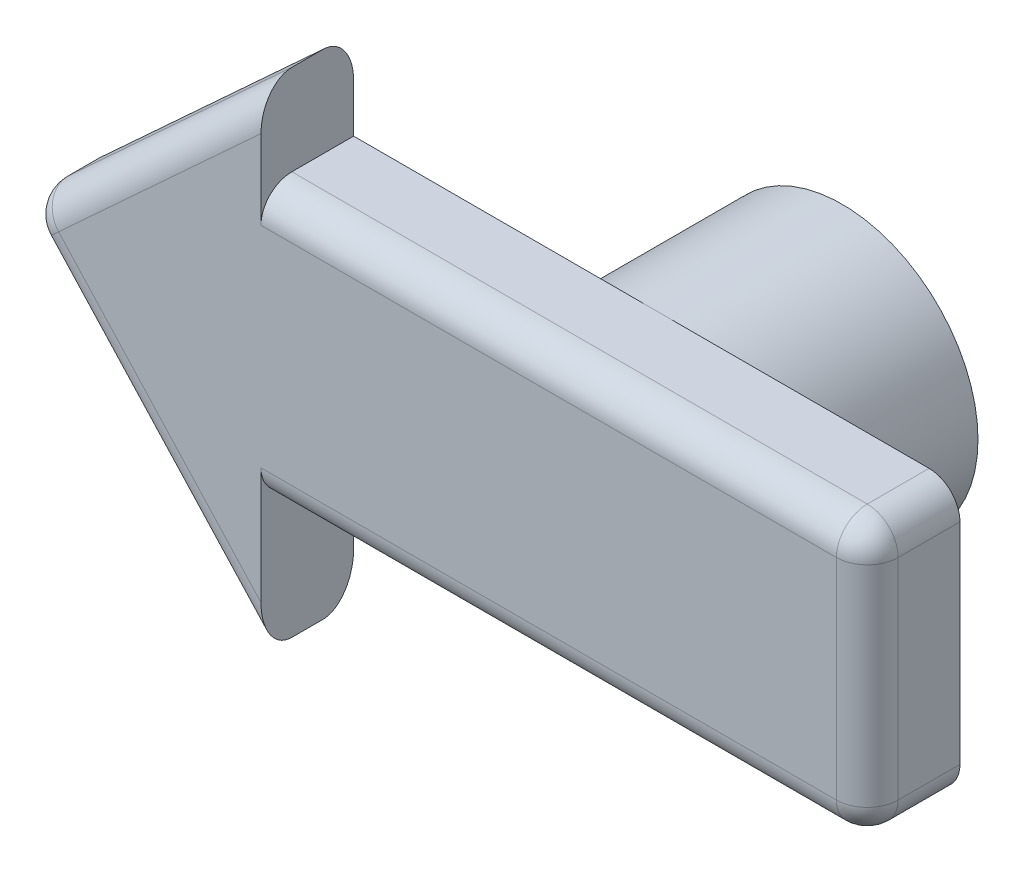
ISO-10303-21;
HEADER;
FILE_DESCRIPTION(('STEP AP214'),'2;1');
FILE_NAME('part.step','',(''),(''),'','','');
FILE_SCHEMA(('AUTOMOTIVE_DESIGN { 1 0 10303 214 1 1 1 1 }'));
ENDSEC;
DATA;
#1=APPLICATION_CONTEXT('core data for automotive mechanical design processes');
#2=APPLICATION_PROTOCOL_DEFINITION('international standard','automotive_design',2000,#1);
#3=PRODUCT_CONTEXT('',#1,'mechanical');
#4=PRODUCT('Part','Part','',(#3));
#5=PRODUCT_RELATED_PRODUCT_CATEGORY('part','',(#4));
#6=PRODUCT_DEFINITION_FORMATION('','',#4);
#7=PRODUCT_DEFINITION_CONTEXT('part definition',#1,'design');
#8=PRODUCT_DEFINITION('design','',#6,#7);
#9=PRODUCT_DEFINITION_SHAPE('','',#8);
#10=(LENGTH_UNIT() NAMED_UNIT(*) SI_UNIT(.MILLI.,.METRE.));
#11=(NAMED_UNIT(*) PLANE_ANGLE_UNIT() SI_UNIT($,.RADIAN.));
#12=(NAMED_UNIT(*) SI_UNIT($,.STERADIAN.) SOLID_ANGLE_UNIT());
#13=UNCERTAINTY_MEASURE_WITH_UNIT(LENGTH_MEASURE(1.E-05),#10,'distance_accuracy_value','');
#14=(GEOMETRIC_REPRESENTATION_CONTEXT(3) GLOBAL_UNCERTAINTY_ASSIGNED_CONTEXT((#13)) GLOBAL_UNIT_ASSIGNED_CONTEXT((#10,
#11,#12)) REPRESENTATION_CONTEXT('',''));
#15=CARTESIAN_POINT('',(0.,0.,0.));
#16=DIRECTION('',(0.,0.,1.));
#17=DIRECTION('',(1.,0.,0.));
#18=AXIS2_PLACEMENT_3D('',#15,#16,#17);
#19=CARTESIAN_POINT('',(0.,-3.7,-6.));
#20=DIRECTION('',(0.,0.,1.));
#21=DIRECTION('',(1.,0.,0.));
#22=AXIS2_PLACEMENT_3D('',#19,#20,#21);
#23=CYLINDRICAL_SURFACE('',#22,4.4);
#24=CARTESIAN_POINT('',(0.,-3.7,-6.));
#25=DIRECTION('',(0.,0.,1.));
#26=DIRECTION('',(1.,0.,0.));
#27=AXIS2_PLACEMENT_3D('',#24,#25,#26);
#28=CIRCLE('',#27,4.4);
#29=CARTESIAN_POINT('',(4.4,-3.7,-6.));
#30=VERTEX_POINT('',#29);
#31=EDGE_CURVE('E203',#30,#30,#28,.T.);
#32=ORIENTED_EDGE('',*,*,#31,.T.);
#33=EDGE_LOOP('',(#32));
#34=FACE_BOUND('',#33,.T.);
#35=CARTESIAN_POINT('',(0.,-3.7,0.));
#36=DIRECTION('',(0.,0.,1.));
#37=DIRECTION('',(1.,0.,0.));
#38=AXIS2_PLACEMENT_3D('',#35,#36,#37);
#39=CIRCLE('',#38,4.4);
#40=CARTESIAN_POINT('',(0.,0.700000000000001,0.));
#41=VERTEX_POINT('',#40);
#42=CARTESIAN_POINT('',(0.,-8.1,0.));
#43=VERTEX_POINT('',#42);
#44=EDGE_CURVE('E175',#41,#43,#39,.T.);
#45=ORIENTED_EDGE('',*,*,#44,.F.);
#46=EDGE_CURVE('E200',#43,#41,#39,.T.);
#47=ORIENTED_EDGE('',*,*,#46,.F.);
#48=EDGE_LOOP('',(#45,#47));
#49=FACE_BOUND('',#48,.T.);
#50=ADVANCED_FACE('F33',(#34,#49),#23,.T.);
#51=CARTESIAN_POINT('',(0.,-3.7,-6.));
#52=DIRECTION('',(0.,0.,1.));
#53=DIRECTION('',(1.,0.,0.));
#54=AXIS2_PLACEMENT_3D('',#51,#52,#53);
#55=PLANE('',#54);
#56=CARTESIAN_POINT('',(0.,-3.7,-6.));
#57=DIRECTION('',(0.,0.,1.));
#58=DIRECTION('',(1.,0.,0.));
#59=AXIS2_PLACEMENT_3D('',#56,#57,#58);
#60=CIRCLE('',#59,3.1);
#61=CARTESIAN_POINT('',(3.1,-3.7,-6.));
#62=VERTEX_POINT('',#61);
#63=EDGE_CURVE('E197',#62,#62,#60,.T.);
#64=ORIENTED_EDGE('',*,*,#63,.T.);
#65=EDGE_LOOP('',(#64));
#66=FACE_BOUND('',#65,.T.);
#67=ORIENTED_EDGE('',*,*,#31,.F.);
#68=EDGE_LOOP('',(#67));
#69=FACE_BOUND('',#68,.T.);
#70=ADVANCED_FACE('F357',(#66,#69),#55,.F.);
#71=CARTESIAN_POINT('',(0.,-3.7,-6.));
#72=DIRECTION('',(0.,0.,1.));
#73=DIRECTION('',(1.,0.,0.));
#74=AXIS2_PLACEMENT_3D('',#71,#72,#73);
#75=CYLINDRICAL_SURFACE('',#74,3.1);
#76=ORIENTED_EDGE('',*,*,#63,.F.);
#77=EDGE_LOOP('',(#76));
#78=FACE_BOUND('',#77,.T.);
#79=CARTESIAN_POINT('',(0.,-3.7,0.));
#80=DIRECTION('',(0.,0.,1.));
#81=DIRECTION('',(1.,0.,0.));
#82=AXIS2_PLACEMENT_3D('',#79,#80,#81);
#83=CIRCLE('',#82,3.1);
#84=CARTESIAN_POINT('',(3.1,-3.7,0.));
#85=VERTEX_POINT('',#84);
#86=EDGE_CURVE('E196',#85,#85,#83,.T.);
#87=ORIENTED_EDGE('',*,*,#86,.T.);
#88=EDGE_LOOP('',(#87));
#89=FACE_BOUND('',#88,.T.);
#90=ADVANCED_FACE('F363',(#78,#89),#75,.F.);
#91=CARTESIAN_POINT('',(0.,0.,0.));
#92=DIRECTION('',(0.,0.,-1.));
#93=DIRECTION('',(-1.,0.,0.));
#94=AXIS2_PLACEMENT_3D('',#91,#92,#93);
#95=PLANE('',#94);
#96=DIRECTION('',(-1.,0.,0.));
#97=VECTOR('',#96,1.);
#98=CARTESIAN_POINT('',(9.81520328825524,0.700000000000001,0.));
#99=LINE('',#98,#97);
#100=CARTESIAN_POINT('',(8.81520328825524,0.700000000000001,0.));
#101=VERTEX_POINT('',#100);
#102=EDGE_CURVE('E184',#101,#41,#99,.T.);
#103=ORIENTED_EDGE('',*,*,#102,.F.);
#104=CARTESIAN_POINT('',(8.81520328825524,-0.299999999999999,0.));
#105=DIRECTION('',(0.,0.,-1.));
#106=DIRECTION('',(-1.,0.,0.));
#107=AXIS2_PLACEMENT_3D('',#104,#105,#106);
#108=CIRCLE('',#107,1.);
#109=CARTESIAN_POINT('',(9.81520328825524,-0.3,0.));
#110=VERTEX_POINT('',#109);
#111=EDGE_CURVE('E256',#101,#110,#108,.T.);
#112=ORIENTED_EDGE('',*,*,#111,.T.);
#113=DIRECTION('',(0.,1.,0.));
#114=VECTOR('',#113,1.);
#115=CARTESIAN_POINT('',(9.81520328825524,-8.1,0.));
#116=LINE('',#115,#114);
#117=CARTESIAN_POINT('',(9.81520328825524,-7.1,0.));
#118=VERTEX_POINT('',#117);
#119=EDGE_CURVE('E177',#118,#110,#116,.T.);
#120=ORIENTED_EDGE('',*,*,#119,.F.);
#121=CARTESIAN_POINT('',(8.81520328825524,-7.1,0.));
#122=DIRECTION('',(0.,0.,-1.));
#123=DIRECTION('',(-1.,0.,0.));
#124=AXIS2_PLACEMENT_3D('',#121,#122,#123);
#125=CIRCLE('',#124,1.);
#126=CARTESIAN_POINT('',(8.81520328825524,-8.1,0.));
#127=VERTEX_POINT('',#126);
#128=EDGE_CURVE('E254',#118,#127,#125,.T.);
#129=ORIENTED_EDGE('',*,*,#128,.T.);
#130=DIRECTION('',(1.,0.,0.));
#131=VECTOR('',#130,1.);
#132=CARTESIAN_POINT('',(9.81520328825524,-8.1,0.));
#133=LINE('',#132,#131);
#134=EDGE_CURVE('E158',#43,#127,#133,.T.);
#135=ORIENTED_EDGE('',*,*,#134,.F.);
#136=ORIENTED_EDGE('',*,*,#46,.T.);
#137=EDGE_LOOP('',(#103,#112,#120,#129,#135,#136));
#138=FACE_BOUND('',#137,.T.);
#139=ADVANCED_FACE('F322',(#138),#95,.T.);
#140=CARTESIAN_POINT('',(0.,0.,3.));
#141=DIRECTION('',(0.,0.,-1.));
#142=DIRECTION('',(-1.,0.,0.));
#143=AXIS2_PLACEMENT_3D('',#140,#141,#142);
#144=PLANE('',#143);
#145=DIRECTION('',(-1.,0.,0.));
#146=VECTOR('',#145,1.);
#147=CARTESIAN_POINT('',(0.,-0.299999999999999,3.));
#148=LINE('',#147,#146);
#149=CARTESIAN_POINT('',(8.81520328825524,-0.299999999999999,3.));
#150=VERTEX_POINT('',#149);
#151=CARTESIAN_POINT('',(-9.81520328825525,-0.299999999999999,3.));
#152=VERTEX_POINT('',#151);
#153=EDGE_CURVE('E217',#150,#152,#148,.T.);
#154=ORIENTED_EDGE('',*,*,#153,.T.);
#155=DIRECTION('',(0.,1.,0.));
#156=VECTOR('',#155,1.);
#157=CARTESIAN_POINT('',(-9.81520328825525,3.62919736532176,3.));
#158=LINE('',#157,#156);
#159=CARTESIAN_POINT('',(-9.81520328825525,2.27021448656478,3.));
#160=VERTEX_POINT('',#159);
#161=EDGE_CURVE('E193',#152,#160,#158,.T.);
#162=ORIENTED_EDGE('',*,*,#161,.T.);
#163=DIRECTION('',(-0.735844443393335,-0.677150614802315,0.));
#164=VECTOR('',#163,1.);
#165=CARTESIAN_POINT('',(-5.63179100691126,6.11994145497162,3.));
#166=LINE('',#165,#164);
#167=CARTESIAN_POINT('',(-16.3666832492243,-3.75869382859102,3.));
#168=VERTEX_POINT('',#167);
#169=EDGE_CURVE('E209',#160,#168,#166,.T.);
#170=ORIENTED_EDGE('',*,*,#169,.T.);
#171=DIRECTION('',(0.677150614802315,-0.735844443393335,0.));
#172=VECTOR('',#171,1.);
#173=CARTESIAN_POINT('',(-10.7348922423131,-9.87863528356264,3.));
#174=LINE('',#173,#172);
#175=CARTESIAN_POINT('',(-9.81520328825525,-10.8780407211421,3.));
#176=VERTEX_POINT('',#175);
#177=EDGE_CURVE('E206',#168,#176,#174,.T.);
#178=ORIENTED_EDGE('',*,*,#177,.T.);
#179=DIRECTION('',(0.,1.,0.));
#180=VECTOR('',#179,1.);
#181=CARTESIAN_POINT('',(-9.81520328825525,-8.1,3.));
#182=LINE('',#181,#180);
#183=CARTESIAN_POINT('',(-9.81520328825525,-7.1,3.));
#184=VERTEX_POINT('',#183);
#185=EDGE_CURVE('E189',#176,#184,#182,.T.);
#186=ORIENTED_EDGE('',*,*,#185,.T.);
#187=DIRECTION('',(1.,0.,0.));
#188=VECTOR('',#187,1.);
#189=CARTESIAN_POINT('',(0.,-7.1,3.));
#190=LINE('',#189,#188);
#191=CARTESIAN_POINT('',(8.81520328825524,-7.1,3.));
#192=VERTEX_POINT('',#191);
#193=EDGE_CURVE('E212',#184,#192,#190,.T.);
#194=ORIENTED_EDGE('',*,*,#193,.T.);
#195=DIRECTION('',(0.,1.,0.));
#196=VECTOR('',#195,1.);
#197=CARTESIAN_POINT('',(8.81520328825524,0.,3.));
#198=LINE('',#197,#196);
#199=EDGE_CURVE('E214',#192,#150,#198,.T.);
#200=ORIENTED_EDGE('',*,*,#199,.T.);
#201=EDGE_LOOP('',(#154,#162,#170,#178,#186,#194,#200));
#202=FACE_BOUND('',#201,.T.);
#203=ADVANCED_FACE('F539',(#202),#144,.F.);
#204=CARTESIAN_POINT('',(-17.77967830742,-3.7,3.));
#205=DIRECTION('',(0.677150614802315,-0.735844443393335,0.));
#206=DIRECTION('',(0.735844443393335,0.677150614802315,0.));
#207=AXIS2_PLACEMENT_3D('',#204,#205,#206);
#208=PLANE('',#207);
#209=DIRECTION('',(0.,0.,-1.));
#210=VECTOR('',#209,1.);
#211=CARTESIAN_POINT('',(-17.0438338640267,-3.02284938519769,3.));
#212=LINE('',#211,#210);
#213=CARTESIAN_POINT('',(-17.0438338640267,-3.02284938519769,1.));
#214=VERTEX_POINT('',#213);
#215=CARTESIAN_POINT('',(-17.0438338640267,-3.02284938519769,2.));
#216=VERTEX_POINT('',#215);
#217=EDGE_CURVE('E233',#214,#216,#212,.F.);
#218=ORIENTED_EDGE('',*,*,#217,.T.);
#219=DIRECTION('',(-0.735844443393335,-0.677150614802315,0.));
#220=VECTOR('',#219,1.);
#221=CARTESIAN_POINT('',(-17.77967830742,-3.7,2.));
#222=LINE('',#221,#220);
#223=CARTESIAN_POINT('',(-9.81520328825525,3.62919736532176,2.));
#224=VERTEX_POINT('',#223);
#225=EDGE_CURVE('E237',#216,#224,#222,.F.);
#226=ORIENTED_EDGE('',*,*,#225,.T.);
#227=DIRECTION('',(0.,0.,-1.));
#228=VECTOR('',#227,1.);
#229=CARTESIAN_POINT('',(-9.81520328825525,3.62919736532176,3.));
#230=LINE('',#229,#228);
#231=CARTESIAN_POINT('',(-9.81520328825525,3.62919736532176,1.));
#232=VERTEX_POINT('',#231);
#233=EDGE_CURVE('E190',#224,#232,#230,.T.);
#234=ORIENTED_EDGE('',*,*,#233,.T.);
#235=DIRECTION('',(-0.735844443393335,-0.677150614802315,0.));
#236=VECTOR('',#235,1.);
#237=CARTESIAN_POINT('',(-17.77967830742,-3.7,1.));
#238=LINE('',#237,#236);
#239=EDGE_CURVE('E235',#232,#214,#238,.T.);
#240=ORIENTED_EDGE('',*,*,#239,.T.);
#241=EDGE_LOOP('',(#218,#226,#234,#240));
#242=FACE_BOUND('',#241,.T.);
#243=ADVANCED_FACE('F301',(#242),#208,.F.);
#244=CARTESIAN_POINT('',(-9.81520328825525,3.62919736532176,3.));
#245=DIRECTION('',(-1.,0.,0.));
#246=DIRECTION('',(0.,0.,1.));
#247=AXIS2_PLACEMENT_3D('',#244,#245,#246);
#248=PLANE('',#247);
#249=ORIENTED_EDGE('',*,*,#233,.F.);
#250=CARTESIAN_POINT('',(-9.81520328825525,2.27021448656478,2.));
#251=DIRECTION('',(-1.,0.,0.));
#252=DIRECTION('',(0.,-1.,0.));
#253=AXIS2_PLACEMENT_3D('',#250,#251,#252);
#254=ELLIPSE('',#253,1.35898287875698,1.);
#255=EDGE_CURVE('E241',#224,#160,#254,.F.);
#256=ORIENTED_EDGE('',*,*,#255,.T.);
#257=ORIENTED_EDGE('',*,*,#161,.F.);
#258=CARTESIAN_POINT('',(-9.81520328825525,-0.299999999999999,2.));
#259=DIRECTION('',(-1.,0.,0.));
#260=DIRECTION('',(0.,0.,1.));
#261=AXIS2_PLACEMENT_3D('',#258,#259,#260);
#262=CIRCLE('',#261,1.);
#263=CARTESIAN_POINT('',(-9.81520328825525,0.700000000000001,2.));
#264=VERTEX_POINT('',#263);
#265=EDGE_CURVE('E42',#152,#264,#262,.T.);
#266=ORIENTED_EDGE('',*,*,#265,.T.);
#267=DIRECTION('',(0.,0.,-1.));
#268=VECTOR('',#267,1.);
#269=CARTESIAN_POINT('',(-9.81520328825525,0.700000000000001,3.));
#270=LINE('',#269,#268);
#271=CARTESIAN_POINT('',(-9.81520328825525,0.700000000000001,0.));
#272=VERTEX_POINT('',#271);
#273=EDGE_CURVE('E169',#264,#272,#270,.T.);
#274=ORIENTED_EDGE('',*,*,#273,.T.);
#275=DIRECTION('',(0.,1.,0.));
#276=VECTOR('',#275,1.);
#277=CARTESIAN_POINT('',(-9.81520328825525,3.62919736532176,0.));
#278=LINE('',#277,#276);
#279=CARTESIAN_POINT('',(-9.81520328825525,2.27021448656478,0.));
#280=VERTEX_POINT('',#279);
#281=EDGE_CURVE('E186',#272,#280,#278,.T.);
#282=ORIENTED_EDGE('',*,*,#281,.T.);
#283=CARTESIAN_POINT('',(-9.81520328825525,2.27021448656478,1.));
#284=DIRECTION('',(-1.,0.,0.));
#285=DIRECTION('',(0.,1.,0.));
#286=AXIS2_PLACEMENT_3D('',#283,#284,#285);
#287=ELLIPSE('',#286,1.35898287875698,1.);
#288=EDGE_CURVE('E239',#280,#232,#287,.F.);
#289=ORIENTED_EDGE('',*,*,#288,.T.);
#290=EDGE_LOOP('',(#249,#256,#257,#266,#274,#282,#289));
#291=FACE_BOUND('',#290,.T.);
#292=ADVANCED_FACE('F309',(#291),#248,.F.);
#293=CARTESIAN_POINT('',(9.81520328825524,0.700000000000001,3.));
#294=DIRECTION('',(0.,-1.,0.));
#295=DIRECTION('',(0.,0.,-1.));
#296=AXIS2_PLACEMENT_3D('',#293,#294,#295);
#297=PLANE('',#296);
#298=ORIENTED_EDGE('',*,*,#273,.F.);
#299=DIRECTION('',(-1.,0.,0.));
#300=VECTOR('',#299,1.);
#301=CARTESIAN_POINT('',(9.81520328825524,0.700000000000001,2.));
#302=LINE('',#301,#300);
#303=CARTESIAN_POINT('',(8.81520328825524,0.700000000000001,2.));
#304=VERTEX_POINT('',#303);
#305=EDGE_CURVE('E228',#264,#304,#302,.F.);
#306=ORIENTED_EDGE('',*,*,#305,.T.);
#307=DIRECTION('',(0.,0.,-1.));
#308=VECTOR('',#307,1.);
#309=CARTESIAN_POINT('',(8.81520328825524,0.700000000000001,3.));
#310=LINE('',#309,#308);
#311=EDGE_CURVE('E226',#304,#101,#310,.T.);
#312=ORIENTED_EDGE('',*,*,#311,.T.);
#313=ORIENTED_EDGE('',*,*,#102,.T.);
#314=EDGE_CURVE('E180',#41,#272,#99,.T.);
#315=ORIENTED_EDGE('',*,*,#314,.T.);
#316=EDGE_LOOP('',(#298,#306,#312,#313,#315));
#317=FACE_BOUND('',#316,.T.);
#318=ADVANCED_FACE('F315',(#317),#297,.F.);
#319=CARTESIAN_POINT('',(9.81520328825524,-8.1,3.));
#320=DIRECTION('',(-1.,0.,0.));
#321=DIRECTION('',(0.,0.,1.));
#322=AXIS2_PLACEMENT_3D('',#319,#320,#321);
#323=PLANE('',#322);
#324=ORIENTED_EDGE('',*,*,#119,.T.);
#325=DIRECTION('',(0.,0.,-1.));
#326=VECTOR('',#325,1.);
#327=CARTESIAN_POINT('',(9.81520328825524,-0.3,3.));
#328=LINE('',#327,#326);
#329=CARTESIAN_POINT('',(9.81520328825524,-0.299999999999999,2.));
#330=VERTEX_POINT('',#329);
#331=EDGE_CURVE('E224',#110,#330,#328,.F.);
#332=ORIENTED_EDGE('',*,*,#331,.T.);
#333=DIRECTION('',(0.,1.,0.));
#334=VECTOR('',#333,1.);
#335=CARTESIAN_POINT('',(9.81520328825524,-8.1,2.));
#336=LINE('',#335,#334);
#337=CARTESIAN_POINT('',(9.81520328825524,-7.1,2.));
#338=VERTEX_POINT('',#337);
#339=EDGE_CURVE('E222',#330,#338,#336,.F.);
#340=ORIENTED_EDGE('',*,*,#339,.T.);
#341=DIRECTION('',(0.,0.,-1.));
#342=VECTOR('',#341,1.);
#343=CARTESIAN_POINT('',(9.81520328825524,-7.1,3.));
#344=LINE('',#343,#342);
#345=EDGE_CURVE('E220',#338,#118,#344,.T.);
#346=ORIENTED_EDGE('',*,*,#345,.T.);
#347=EDGE_LOOP('',(#324,#332,#340,#346));
#348=FACE_BOUND('',#347,.T.);
#349=ADVANCED_FACE('F509',(#348),#323,.F.);
#350=CARTESIAN_POINT('',(9.81520328825524,-8.1,3.));
#351=DIRECTION('',(0.,1.,0.));
#352=DIRECTION('',(0.,0.,1.));
#353=AXIS2_PLACEMENT_3D('',#350,#351,#352);
#354=PLANE('',#353);
#355=DIRECTION('',(0.,0.,-1.));
#356=VECTOR('',#355,1.);
#357=CARTESIAN_POINT('',(8.81520328825524,-8.1,3.));
#358=LINE('',#357,#356);
#359=CARTESIAN_POINT('',(8.81520328825524,-8.1,2.));
#360=VERTEX_POINT('',#359);
#361=EDGE_CURVE('E230',#127,#360,#358,.F.);
#362=ORIENTED_EDGE('',*,*,#361,.T.);
#363=DIRECTION('',(1.,0.,0.));
#364=VECTOR('',#363,1.);
#365=CARTESIAN_POINT('',(9.81520328825524,-8.1,2.));
#366=LINE('',#365,#364);
#367=CARTESIAN_POINT('',(-9.81520328825525,-8.1,2.));
#368=VERTEX_POINT('',#367);
#369=EDGE_CURVE('E167',#360,#368,#366,.F.);
#370=ORIENTED_EDGE('',*,*,#369,.T.);
#371=DIRECTION('',(0.,0.,-1.));
#372=VECTOR('',#371,1.);
#373=CARTESIAN_POINT('',(-9.81520328825525,-8.1,3.));
#374=LINE('',#373,#372);
#375=CARTESIAN_POINT('',(-9.81520328825525,-8.1,0.));
#376=VERTEX_POINT('',#375);
#377=EDGE_CURVE('E152',#368,#376,#374,.T.);
#378=ORIENTED_EDGE('',*,*,#377,.T.);
#379=EDGE_CURVE('E165',#376,#43,#133,.T.);
#380=ORIENTED_EDGE('',*,*,#379,.T.);
#381=ORIENTED_EDGE('',*,*,#134,.T.);
#382=EDGE_LOOP('',(#362,#370,#378,#380,#381));
#383=FACE_BOUND('',#382,.T.);
#384=ADVANCED_FACE('F163',(#383),#354,.F.);
#385=CARTESIAN_POINT('',(-9.81520328825525,-8.1,3.));
#386=DIRECTION('',(-1.,0.,0.));
#387=DIRECTION('',(0.,0.,1.));
#388=AXIS2_PLACEMENT_3D('',#385,#386,#387);
#389=PLANE('',#388);
#390=ORIENTED_EDGE('',*,*,#185,.F.);
#391=CARTESIAN_POINT('',(-9.81520328825525,-10.8780407211421,2.));
#392=DIRECTION('',(-1.,0.,0.));
#393=DIRECTION('',(0.,-1.,0.));
#394=AXIS2_PLACEMENT_3D('',#391,#392,#393);
#395=ELLIPSE('',#394,1.4767763303175,1.);
#396=CARTESIAN_POINT('',(-9.81520328825525,-12.3548170514596,2.));
#397=VERTEX_POINT('',#396);
#398=EDGE_CURVE('E244',#176,#397,#395,.F.);
#399=ORIENTED_EDGE('',*,*,#398,.T.);
#400=DIRECTION('',(0.,0.,-1.));
#401=VECTOR('',#400,1.);
#402=CARTESIAN_POINT('',(-9.81520328825525,-12.3548170514596,3.));
#403=LINE('',#402,#401);
#404=CARTESIAN_POINT('',(-9.81520328825525,-12.3548170514596,1.));
#405=VERTEX_POINT('',#404);
#406=EDGE_CURVE('E168',#397,#405,#403,.T.);
#407=ORIENTED_EDGE('',*,*,#406,.T.);
#408=CARTESIAN_POINT('',(-9.81520328825525,-10.8780407211421,1.));
#409=DIRECTION('',(-1.,0.,0.));
#410=DIRECTION('',(0.,1.,0.));
#411=AXIS2_PLACEMENT_3D('',#408,#409,#410);
#412=ELLIPSE('',#411,1.4767763303175,1.);
#413=CARTESIAN_POINT('',(-9.81520328825525,-10.8780407211421,0.));
#414=VERTEX_POINT('',#413);
#415=EDGE_CURVE('E156',#405,#414,#412,.F.);
#416=ORIENTED_EDGE('',*,*,#415,.T.);
#417=DIRECTION('',(0.,1.,0.));
#418=VECTOR('',#417,1.);
#419=CARTESIAN_POINT('',(-9.81520328825525,-8.1,0.));
#420=LINE('',#419,#418);
#421=EDGE_CURVE('E148',#414,#376,#420,.T.);
#422=ORIENTED_EDGE('',*,*,#421,.T.);
#423=ORIENTED_EDGE('',*,*,#377,.F.);
#424=CARTESIAN_POINT('',(-9.81520328825525,-7.1,2.));
#425=DIRECTION('',(-1.,0.,0.));
#426=DIRECTION('',(0.,0.,1.));
#427=AXIS2_PLACEMENT_3D('',#424,#425,#426);
#428=CIRCLE('',#427,1.);
#429=EDGE_CURVE('E11',#368,#184,#428,.T.);
#430=ORIENTED_EDGE('',*,*,#429,.T.);
#431=EDGE_LOOP('',(#390,#399,#407,#416,#422,#423,#430));
#432=FACE_BOUND('',#431,.T.);
#433=ADVANCED_FACE('F151',(#432),#389,.F.);
#434=CARTESIAN_POINT('',(-9.81520328825525,-12.3548170514596,3.));
#435=DIRECTION('',(0.735844443393335,0.677150614802315,0.));
#436=DIRECTION('',(-0.677150614802315,0.735844443393335,0.));
#437=AXIS2_PLACEMENT_3D('',#434,#435,#436);
#438=PLANE('',#437);
#439=ORIENTED_EDGE('',*,*,#406,.F.);
#440=DIRECTION('',(0.677150614802315,-0.735844443393335,0.));
#441=VECTOR('',#440,1.);
#442=CARTESIAN_POINT('',(-9.81520328825525,-12.3548170514596,2.));
#443=LINE('',#442,#441);
#444=CARTESIAN_POINT('',(-17.1025276926177,-4.43584444339334,2.));
#445=VERTEX_POINT('',#444);
#446=EDGE_CURVE('E249',#397,#445,#443,.F.);
#447=ORIENTED_EDGE('',*,*,#446,.T.);
#448=DIRECTION('',(0.,0.,-1.));
#449=VECTOR('',#448,1.);
#450=CARTESIAN_POINT('',(-17.1025276926177,-4.43584444339334,3.));
#451=LINE('',#450,#449);
#452=CARTESIAN_POINT('',(-17.1025276926177,-4.43584444339334,1.));
#453=VERTEX_POINT('',#452);
#454=EDGE_CURVE('E58',#445,#453,#451,.T.);
#455=ORIENTED_EDGE('',*,*,#454,.T.);
#456=DIRECTION('',(0.677150614802315,-0.735844443393335,0.));
#457=VECTOR('',#456,1.);
#458=CARTESIAN_POINT('',(-9.81520328825525,-12.3548170514596,1.));
#459=LINE('',#458,#457);
#460=EDGE_CURVE('E247',#453,#405,#459,.T.);
#461=ORIENTED_EDGE('',*,*,#460,.T.);
#462=EDGE_LOOP('',(#439,#447,#455,#461));
#463=FACE_BOUND('',#462,.T.);
#464=ADVANCED_FACE('F346',(#463),#438,.F.);
#465=ORIENTED_EDGE('',*,*,#421,.F.);
#466=DIRECTION('',(0.677150614802315,-0.735844443393335,0.));
#467=VECTOR('',#466,1.);
#468=CARTESIAN_POINT('',(-17.0438338640267,-3.02284938519768,0.));
#469=LINE('',#468,#467);
#470=CARTESIAN_POINT('',(-16.3666832492243,-3.75869382859102,0.));
#471=VERTEX_POINT('',#470);
#472=EDGE_CURVE('E50',#414,#471,#469,.F.);
#473=ORIENTED_EDGE('',*,*,#472,.T.);
#474=DIRECTION('',(-0.735844443393335,-0.677150614802315,0.));
#475=VECTOR('',#474,1.);
#476=CARTESIAN_POINT('',(-9.13805267345293,2.89335292192843,0.));
#477=LINE('',#476,#475);
#478=EDGE_CURVE('E251',#471,#280,#477,.F.);
#479=ORIENTED_EDGE('',*,*,#478,.T.);
#480=ORIENTED_EDGE('',*,*,#281,.F.);
#481=ORIENTED_EDGE('',*,*,#314,.F.);
#482=ORIENTED_EDGE('',*,*,#44,.T.);
#483=ORIENTED_EDGE('',*,*,#379,.F.);
#484=EDGE_LOOP('',(#465,#473,#479,#480,#481,#482,#483));
#485=FACE_BOUND('',#484,.T.);
#486=ADVANCED_FACE('F172',(#485),#95,.T.);
#487=ORIENTED_EDGE('',*,*,#86,.F.);
#488=EDGE_LOOP('',(#487));
#489=FACE_BOUND('',#488,.T.);
#490=ADVANCED_FACE('F385',(#489),#95,.T.);
#491=CARTESIAN_POINT('',(8.81520328825524,-7.1,3.));
#492=DIRECTION('',(0.,0.,-1.));
#493=DIRECTION('',(-1.,0.,0.));
#494=AXIS2_PLACEMENT_3D('',#491,#492,#493);
#495=CYLINDRICAL_SURFACE('',#494,1.);
#496=ORIENTED_EDGE('',*,*,#128,.F.);
#497=ORIENTED_EDGE('',*,*,#345,.F.);
#498=CARTESIAN_POINT('',(8.81520328825524,-7.1,2.));
#499=DIRECTION('',(0.,0.,1.));
#500=DIRECTION('',(1.,0.,0.));
#501=AXIS2_PLACEMENT_3D('',#498,#499,#500);
#502=CIRCLE('',#501,1.);
#503=EDGE_CURVE('E159',#360,#338,#502,.T.);
#504=ORIENTED_EDGE('',*,*,#503,.F.);
#505=ORIENTED_EDGE('',*,*,#361,.F.);
#506=EDGE_LOOP('',(#496,#497,#504,#505));
#507=FACE_BOUND('',#506,.T.);
#508=ADVANCED_FACE('F328',(#507),#495,.T.);
#509=CARTESIAN_POINT('',(0.,-7.1,2.));
#510=DIRECTION('',(1.,0.,0.));
#511=DIRECTION('',(0.,0.,-1.));
#512=AXIS2_PLACEMENT_3D('',#509,#510,#511);
#513=CYLINDRICAL_SURFACE('',#512,1.);
#514=ORIENTED_EDGE('',*,*,#429,.F.);
#515=ORIENTED_EDGE('',*,*,#369,.F.);
#516=CARTESIAN_POINT('',(8.81520328825524,-7.1,2.));
#517=DIRECTION('',(1.,0.,0.));
#518=DIRECTION('',(0.,0.,-1.));
#519=AXIS2_PLACEMENT_3D('',#516,#517,#518);
#520=CIRCLE('',#519,1.);
#521=EDGE_CURVE('E270',#192,#360,#520,.T.);
#522=ORIENTED_EDGE('',*,*,#521,.F.);
#523=ORIENTED_EDGE('',*,*,#193,.F.);
#524=EDGE_LOOP('',(#514,#515,#522,#523));
#525=FACE_BOUND('',#524,.T.);
#526=ADVANCED_FACE('F337',(#525),#513,.T.);
#527=CARTESIAN_POINT('',(0.,-0.299999999999999,2.));
#528=DIRECTION('',(-1.,0.,0.));
#529=DIRECTION('',(0.,0.,1.));
#530=AXIS2_PLACEMENT_3D('',#527,#528,#529);
#531=CYLINDRICAL_SURFACE('',#530,1.);
#532=ORIENTED_EDGE('',*,*,#265,.F.);
#533=ORIENTED_EDGE('',*,*,#153,.F.);
#534=CARTESIAN_POINT('',(8.81520328825524,-0.299999999999999,2.));
#535=DIRECTION('',(1.,0.,0.));
#536=DIRECTION('',(0.,0.,-1.));
#537=AXIS2_PLACEMENT_3D('',#534,#535,#536);
#538=CIRCLE('',#537,1.);
#539=EDGE_CURVE('E267',#304,#150,#538,.T.);
#540=ORIENTED_EDGE('',*,*,#539,.F.);
#541=ORIENTED_EDGE('',*,*,#305,.F.);
#542=EDGE_LOOP('',(#532,#533,#540,#541));
#543=FACE_BOUND('',#542,.T.);
#544=ADVANCED_FACE('F376',(#543),#531,.T.);
#545=CARTESIAN_POINT('',(8.81520328825524,-0.299999999999999,3.));
#546=DIRECTION('',(0.,0.,-1.));
#547=DIRECTION('',(-1.,0.,0.));
#548=AXIS2_PLACEMENT_3D('',#545,#546,#547);
#549=CYLINDRICAL_SURFACE('',#548,1.);
#550=ORIENTED_EDGE('',*,*,#111,.F.);
#551=ORIENTED_EDGE('',*,*,#311,.F.);
#552=CARTESIAN_POINT('',(8.81520328825524,-0.299999999999999,2.));
#553=DIRECTION('',(0.,0.,1.));
#554=DIRECTION('',(1.,0.,0.));
#555=AXIS2_PLACEMENT_3D('',#552,#553,#554);
#556=CIRCLE('',#555,1.);
#557=EDGE_CURVE('E264',#330,#304,#556,.T.);
#558=ORIENTED_EDGE('',*,*,#557,.F.);
#559=ORIENTED_EDGE('',*,*,#331,.F.);
#560=EDGE_LOOP('',(#550,#551,#558,#559));
#561=FACE_BOUND('',#560,.T.);
#562=ADVANCED_FACE('F373',(#561),#549,.T.);
#563=CARTESIAN_POINT('',(8.81520328825524,-7.1,2.));
#564=DIRECTION('',(0.,0.,1.));
#565=DIRECTION('',(1.,0.,0.));
#566=AXIS2_PLACEMENT_3D('',#563,#564,#565);
#567=SPHERICAL_SURFACE('',#566,1.);
#568=ORIENTED_EDGE('',*,*,#521,.T.);
#569=ORIENTED_EDGE('',*,*,#503,.T.);
#570=CARTESIAN_POINT('',(8.81520328825524,-7.1,2.));
#571=DIRECTION('',(0.,-1.,0.));
#572=DIRECTION('',(0.,0.,-1.));
#573=AXIS2_PLACEMENT_3D('',#570,#571,#572);
#574=CIRCLE('',#573,1.);
#575=EDGE_CURVE('E261',#192,#338,#574,.F.);
#576=ORIENTED_EDGE('',*,*,#575,.F.);
#577=EDGE_LOOP('',(#568,#569,#576));
#578=FACE_BOUND('',#577,.T.);
#579=ADVANCED_FACE('F333',(#578),#567,.T.);
#580=CARTESIAN_POINT('',(8.81520328825524,-0.299999999999999,2.));
#581=DIRECTION('',(0.,0.,1.));
#582=DIRECTION('',(1.,0.,0.));
#583=AXIS2_PLACEMENT_3D('',#580,#581,#582);
#584=SPHERICAL_SURFACE('',#583,1.);
#585=ORIENTED_EDGE('',*,*,#557,.T.);
#586=ORIENTED_EDGE('',*,*,#539,.T.);
#587=CARTESIAN_POINT('',(8.81520328825524,-0.299999999999999,2.));
#588=DIRECTION('',(0.,1.,0.));
#589=DIRECTION('',(0.,0.,1.));
#590=AXIS2_PLACEMENT_3D('',#587,#588,#589);
#591=CIRCLE('',#590,1.);
#592=EDGE_CURVE('E259',#330,#150,#591,.F.);
#593=ORIENTED_EDGE('',*,*,#592,.F.);
#594=EDGE_LOOP('',(#585,#586,#593));
#595=FACE_BOUND('',#594,.T.);
#596=ADVANCED_FACE('F353',(#595),#584,.T.);
#597=CARTESIAN_POINT('',(8.81520328825524,0.,2.));
#598=DIRECTION('',(0.,1.,0.));
#599=DIRECTION('',(0.,0.,1.));
#600=AXIS2_PLACEMENT_3D('',#597,#598,#599);
#601=CYLINDRICAL_SURFACE('',#600,1.);
#602=ORIENTED_EDGE('',*,*,#575,.T.);
#603=ORIENTED_EDGE('',*,*,#339,.F.);
#604=ORIENTED_EDGE('',*,*,#592,.T.);
#605=ORIENTED_EDGE('',*,*,#199,.F.);
#606=EDGE_LOOP('',(#602,#603,#604,#605));
#607=FACE_BOUND('',#606,.T.);
#608=ADVANCED_FACE('F348',(#607),#601,.T.);
#609=CARTESIAN_POINT('',(-9.07935884486191,-11.6776664366573,1.));
#610=DIRECTION('',(-0.677150614802315,0.735844443393335,0.));
#611=DIRECTION('',(-0.735844443393335,-0.677150614802315,0.));
#612=AXIS2_PLACEMENT_3D('',#609,#610,#611);
#613=CYLINDRICAL_SURFACE('',#612,1.);
#614=ORIENTED_EDGE('',*,*,#415,.F.);
#615=ORIENTED_EDGE('',*,*,#460,.F.);
#616=CARTESIAN_POINT('',(-16.3666832492243,-3.75869382859102,1.));
#617=DIRECTION('',(-0.677150614802316,0.735844443393334,0.));
#618=DIRECTION('',(-0.735844443393334,-0.677150614802316,0.));
#619=AXIS2_PLACEMENT_3D('',#616,#617,#618);
#620=CIRCLE('',#619,1.);
#621=EDGE_CURVE('E37',#471,#453,#620,.T.);
#622=ORIENTED_EDGE('',*,*,#621,.F.);
#623=ORIENTED_EDGE('',*,*,#472,.F.);
#624=EDGE_LOOP('',(#614,#615,#622,#623));
#625=FACE_BOUND('',#624,.T.);
#626=ADVANCED_FACE('F35',(#625),#613,.T.);
#627=CARTESIAN_POINT('',(-17.1025276926177,-4.43584444339334,1.));
#628=DIRECTION('',(0.735844443393335,0.677150614802315,0.));
#629=DIRECTION('',(-0.677150614802315,0.735844443393335,0.));
#630=AXIS2_PLACEMENT_3D('',#627,#628,#629);
#631=CYLINDRICAL_SURFACE('',#630,1.);
#632=ORIENTED_EDGE('',*,*,#288,.F.);
#633=ORIENTED_EDGE('',*,*,#478,.F.);
#634=CARTESIAN_POINT('',(-16.3666832492243,-3.75869382859102,1.));
#635=DIRECTION('',(-0.735844443393335,-0.677150614802315,0.));
#636=DIRECTION('',(0.677150614802315,-0.735844443393335,0.));
#637=AXIS2_PLACEMENT_3D('',#634,#635,#636);
#638=CIRCLE('',#637,1.);
#639=EDGE_CURVE('E285',#214,#471,#638,.T.);
#640=ORIENTED_EDGE('',*,*,#639,.F.);
#641=ORIENTED_EDGE('',*,*,#239,.F.);
#642=EDGE_LOOP('',(#632,#633,#640,#641));
#643=FACE_BOUND('',#642,.T.);
#644=ADVANCED_FACE('F306',(#643),#631,.T.);
#645=CARTESIAN_POINT('',(-16.3666832492243,-3.75869382859102,1.));
#646=DIRECTION('',(0.,0.,1.));
#647=DIRECTION('',(1.,0.,0.));
#648=AXIS2_PLACEMENT_3D('',#645,#646,#647);
#649=SPHERICAL_SURFACE('',#648,1.);
#650=ORIENTED_EDGE('',*,*,#639,.T.);
#651=ORIENTED_EDGE('',*,*,#621,.T.);
#652=CARTESIAN_POINT('',(-16.3666832492243,-3.75869382859102,1.));
#653=DIRECTION('',(0.,0.,-1.));
#654=DIRECTION('',(-1.,0.,0.));
#655=AXIS2_PLACEMENT_3D('',#652,#653,#654);
#656=CIRCLE('',#655,1.);
#657=EDGE_CURVE('E283',#214,#453,#656,.F.);
#658=ORIENTED_EDGE('',*,*,#657,.F.);
#659=EDGE_LOOP('',(#650,#651,#658));
#660=FACE_BOUND('',#659,.T.);
#661=ADVANCED_FACE('F292',(#660),#649,.T.);
#662=CARTESIAN_POINT('',(-10.7348922423131,-9.87863528356264,2.));
#663=DIRECTION('',(0.677150614802315,-0.735844443393335,0.));
#664=DIRECTION('',(0.735844443393335,0.677150614802315,0.));
#665=AXIS2_PLACEMENT_3D('',#662,#663,#664);
#666=CYLINDRICAL_SURFACE('',#665,1.);
#667=ORIENTED_EDGE('',*,*,#398,.F.);
#668=ORIENTED_EDGE('',*,*,#177,.F.);
#669=CARTESIAN_POINT('',(-16.3666832492243,-3.75869382859102,2.));
#670=DIRECTION('',(-0.677150614802315,0.735844443393335,0.));
#671=DIRECTION('',(-0.735844443393335,-0.677150614802315,0.));
#672=AXIS2_PLACEMENT_3D('',#669,#670,#671);
#673=CIRCLE('',#672,1.);
#674=EDGE_CURVE('E280',#445,#168,#673,.T.);
#675=ORIENTED_EDGE('',*,*,#674,.F.);
#676=ORIENTED_EDGE('',*,*,#446,.F.);
#677=EDGE_LOOP('',(#667,#668,#675,#676));
#678=FACE_BOUND('',#677,.T.);
#679=ADVANCED_FACE('F345',(#678),#666,.T.);
#680=CARTESIAN_POINT('',(-16.3666832492243,-3.75869382859102,3.));
#681=DIRECTION('',(0.,0.,-1.));
#682=DIRECTION('',(-1.,0.,0.));
#683=AXIS2_PLACEMENT_3D('',#680,#681,#682);
#684=CYLINDRICAL_SURFACE('',#683,1.);
#685=ORIENTED_EDGE('',*,*,#657,.T.);
#686=ORIENTED_EDGE('',*,*,#454,.F.);
#687=CARTESIAN_POINT('',(-16.3666832492243,-3.75869382859102,2.));
#688=DIRECTION('',(0.,0.,1.));
#689=DIRECTION('',(1.,0.,0.));
#690=AXIS2_PLACEMENT_3D('',#687,#688,#689);
#691=CIRCLE('',#690,1.);
#692=EDGE_CURVE('E277',#216,#445,#691,.T.);
#693=ORIENTED_EDGE('',*,*,#692,.F.);
#694=ORIENTED_EDGE('',*,*,#217,.F.);
#695=EDGE_LOOP('',(#685,#686,#693,#694));
#696=FACE_BOUND('',#695,.T.);
#697=ADVANCED_FACE('F296',(#696),#684,.T.);
#698=CARTESIAN_POINT('',(-16.3666832492243,-3.75869382859102,2.));
#699=DIRECTION('',(0.,0.,1.));
#700=DIRECTION('',(1.,0.,0.));
#701=AXIS2_PLACEMENT_3D('',#698,#699,#700);
#702=SPHERICAL_SURFACE('',#701,1.);
#703=ORIENTED_EDGE('',*,*,#692,.T.);
#704=ORIENTED_EDGE('',*,*,#674,.T.);
#705=CARTESIAN_POINT('',(-16.3666832492243,-3.75869382859102,2.));
#706=DIRECTION('',(-0.735844443393335,-0.677150614802315,0.));
#707=DIRECTION('',(0.677150614802315,-0.735844443393335,0.));
#708=AXIS2_PLACEMENT_3D('',#705,#706,#707);
#709=CIRCLE('',#708,1.);
#710=EDGE_CURVE('E275',#216,#168,#709,.F.);
#711=ORIENTED_EDGE('',*,*,#710,.F.);
#712=EDGE_LOOP('',(#703,#704,#711));
#713=FACE_BOUND('',#712,.T.);
#714=ADVANCED_FACE('F389',(#713),#702,.T.);
#715=CARTESIAN_POINT('',(-5.63179100691126,6.11994145497162,2.));
#716=DIRECTION('',(-0.735844443393335,-0.677150614802315,0.));
#717=DIRECTION('',(0.677150614802315,-0.735844443393335,0.));
#718=AXIS2_PLACEMENT_3D('',#715,#716,#717);
#719=CYLINDRICAL_SURFACE('',#718,1.);
#720=ORIENTED_EDGE('',*,*,#255,.F.);
#721=ORIENTED_EDGE('',*,*,#225,.F.);
#722=ORIENTED_EDGE('',*,*,#710,.T.);
#723=ORIENTED_EDGE('',*,*,#169,.F.);
#724=EDGE_LOOP('',(#720,#721,#722,#723));
#725=FACE_BOUND('',#724,.T.);
#726=ADVANCED_FACE('F386',(#725),#719,.T.);
#727=CLOSED_SHELL('',(#50,#70,#90,#139,#203,#243,#292,#318,#349,#384,#433,#464,#486,#490,#508,
#526,#544,#562,#579,#596,#608,#626,#644,#661,#679,#697,#714,#726));
#728=MANIFOLD_SOLID_BREP('B2',#727);
#729=ADVANCED_BREP_SHAPE_REPRESENTATION('',(#18,#728),#14);
#730=SHAPE_DEFINITION_REPRESENTATION(#9,#729);
ENDSEC;
END-ISO-10303-21;
